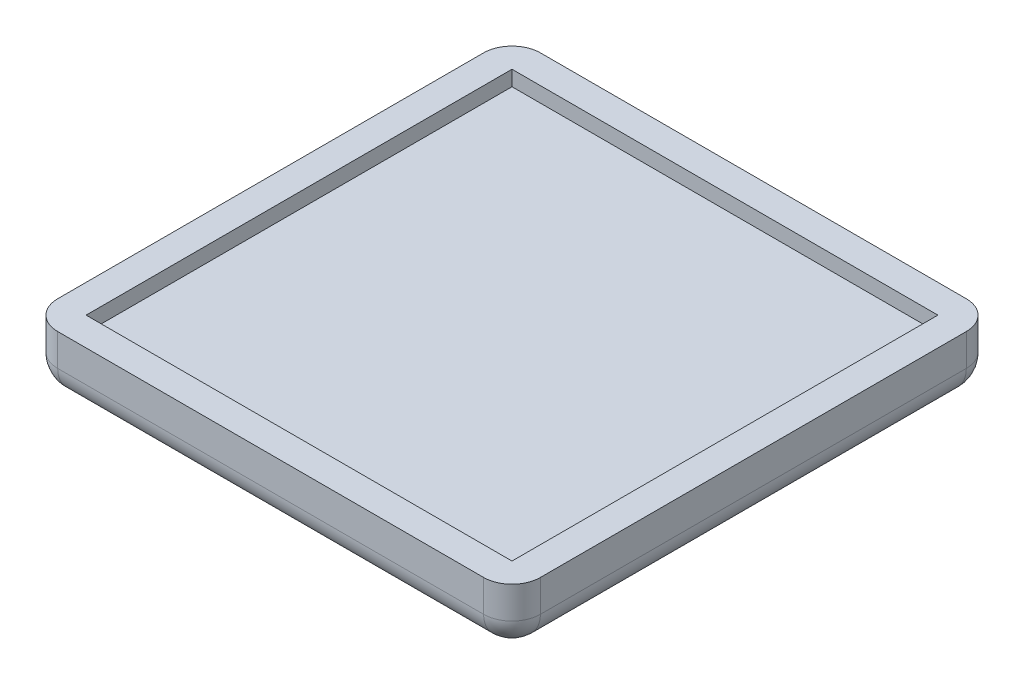
ISO-10303-21;
HEADER;
FILE_DESCRIPTION(('STEP AP214'),'2;1');
FILE_NAME('part.step','',(''),(''),'','','');
FILE_SCHEMA(('AUTOMOTIVE_DESIGN { 1 0 10303 214 1 1 1 1 }'));
ENDSEC;
DATA;
#1=APPLICATION_CONTEXT('core data for automotive mechanical design processes');
#2=APPLICATION_PROTOCOL_DEFINITION('international standard','automotive_design',2000,#1);
#3=PRODUCT_CONTEXT('',#1,'mechanical');
#4=PRODUCT('Part','Part','',(#3));
#5=PRODUCT_RELATED_PRODUCT_CATEGORY('part','',(#4));
#6=PRODUCT_DEFINITION_FORMATION('','',#4);
#7=PRODUCT_DEFINITION_CONTEXT('part definition',#1,'design');
#8=PRODUCT_DEFINITION('design','',#6,#7);
#9=PRODUCT_DEFINITION_SHAPE('','',#8);
#10=(LENGTH_UNIT() NAMED_UNIT(*) SI_UNIT(.MILLI.,.METRE.));
#11=(NAMED_UNIT(*) PLANE_ANGLE_UNIT() SI_UNIT($,.RADIAN.));
#12=(NAMED_UNIT(*) SI_UNIT($,.STERADIAN.) SOLID_ANGLE_UNIT());
#13=UNCERTAINTY_MEASURE_WITH_UNIT(LENGTH_MEASURE(1.E-05),#10,'distance_accuracy_value','');
#14=(GEOMETRIC_REPRESENTATION_CONTEXT(3) GLOBAL_UNCERTAINTY_ASSIGNED_CONTEXT((#13)) GLOBAL_UNIT_ASSIGNED_CONTEXT((#10,
#11,#12)) REPRESENTATION_CONTEXT('',''));
#15=CARTESIAN_POINT('',(0.,0.,0.));
#16=DIRECTION('',(0.,0.,1.));
#17=DIRECTION('',(1.,0.,0.));
#18=AXIS2_PLACEMENT_3D('',#15,#16,#17);
#19=CARTESIAN_POINT('',(0.,-5.715,0.));
#20=DIRECTION('',(0.,0.,1.));
#21=DIRECTION('',(1.,0.,0.));
#22=AXIS2_PLACEMENT_3D('',#19,#20,#21);
#23=PLANE('',#22);
#24=DIRECTION('',(1.,0.,0.));
#25=VECTOR('',#24,1.);
#26=CARTESIAN_POINT('',(76.2,-2.715,0.));
#27=LINE('',#26,#25);
#28=CARTESIAN_POINT('',(0.,-2.715,0.));
#29=VERTEX_POINT('',#28);
#30=CARTESIAN_POINT('',(76.2,-2.715,0.));
#31=VERTEX_POINT('',#30);
#32=EDGE_CURVE('E140',#29,#31,#27,.T.);
#33=ORIENTED_EDGE('',*,*,#32,.F.);
#34=DIRECTION('',(0.,1.,0.));
#35=VECTOR('',#34,1.);
#36=CARTESIAN_POINT('',(0.,-5.715,0.));
#37=LINE('',#36,#35);
#38=CARTESIAN_POINT('',(0.,0.,0.));
#39=VERTEX_POINT('',#38);
#40=EDGE_CURVE('E162',#29,#39,#37,.T.);
#41=ORIENTED_EDGE('',*,*,#40,.T.);
#42=DIRECTION('',(1.,0.,0.));
#43=VECTOR('',#42,1.);
#44=CARTESIAN_POINT('',(0.,0.,0.));
#45=LINE('',#44,#43);
#46=CARTESIAN_POINT('',(76.2,0.,0.));
#47=VERTEX_POINT('',#46);
#48=EDGE_CURVE('E256',#39,#47,#45,.T.);
#49=ORIENTED_EDGE('',*,*,#48,.T.);
#50=DIRECTION('',(0.,1.,0.));
#51=VECTOR('',#50,1.);
#52=CARTESIAN_POINT('',(76.2,-5.715,0.));
#53=LINE('',#52,#51);
#54=EDGE_CURVE('E158',#31,#47,#53,.T.);
#55=ORIENTED_EDGE('',*,*,#54,.F.);
#56=EDGE_LOOP('',(#33,#41,#49,#55));
#57=FACE_BOUND('',#56,.T.);
#58=ADVANCED_FACE('F37',(#57),#23,.F.);
#59=CARTESIAN_POINT('',(76.2,-5.715,0.));
#60=DIRECTION('',(1.,0.,0.));
#61=DIRECTION('',(0.,0.,-1.));
#62=AXIS2_PLACEMENT_3D('',#59,#60,#61);
#63=PLANE('',#62);
#64=DIRECTION('',(0.,0.,-1.));
#65=VECTOR('',#64,1.);
#66=CARTESIAN_POINT('',(76.2,-2.715,-76.2));
#67=LINE('',#66,#65);
#68=CARTESIAN_POINT('',(76.2,-2.715,-76.2));
#69=VERTEX_POINT('',#68);
#70=EDGE_CURVE('E137',#31,#69,#67,.T.);
#71=ORIENTED_EDGE('',*,*,#70,.F.);
#72=ORIENTED_EDGE('',*,*,#54,.T.);
#73=DIRECTION('',(0.,0.,-1.));
#74=VECTOR('',#73,1.);
#75=CARTESIAN_POINT('',(76.2,0.,0.));
#76=LINE('',#75,#74);
#77=CARTESIAN_POINT('',(76.2,0.,-76.2));
#78=VERTEX_POINT('',#77);
#79=EDGE_CURVE('E156',#47,#78,#76,.T.);
#80=ORIENTED_EDGE('',*,*,#79,.T.);
#81=DIRECTION('',(0.,1.,0.));
#82=VECTOR('',#81,1.);
#83=CARTESIAN_POINT('',(76.2,-5.715,-76.2));
#84=LINE('',#83,#82);
#85=EDGE_CURVE('E149',#69,#78,#84,.T.);
#86=ORIENTED_EDGE('',*,*,#85,.F.);
#87=EDGE_LOOP('',(#71,#72,#80,#86));
#88=FACE_BOUND('',#87,.T.);
#89=ADVANCED_FACE('F154',(#88),#63,.F.);
#90=CARTESIAN_POINT('',(0.,-5.715,-76.2));
#91=DIRECTION('',(0.,0.,1.));
#92=DIRECTION('',(1.,0.,0.));
#93=AXIS2_PLACEMENT_3D('',#90,#91,#92);
#94=PLANE('',#93);
#95=DIRECTION('',(0.,1.,0.));
#96=VECTOR('',#95,1.);
#97=CARTESIAN_POINT('',(0.,-5.715,-76.2));
#98=LINE('',#97,#96);
#99=CARTESIAN_POINT('',(0.,-2.715,-76.2));
#100=VERTEX_POINT('',#99);
#101=CARTESIAN_POINT('',(0.,0.,-76.2));
#102=VERTEX_POINT('',#101);
#103=EDGE_CURVE('E151',#100,#102,#98,.T.);
#104=ORIENTED_EDGE('',*,*,#103,.F.);
#105=DIRECTION('',(-1.,0.,0.));
#106=VECTOR('',#105,1.);
#107=CARTESIAN_POINT('',(76.2,-2.715,-76.2));
#108=LINE('',#107,#106);
#109=EDGE_CURVE('E54',#69,#100,#108,.T.);
#110=ORIENTED_EDGE('',*,*,#109,.F.);
#111=ORIENTED_EDGE('',*,*,#85,.T.);
#112=DIRECTION('',(1.,0.,0.));
#113=VECTOR('',#112,1.);
#114=CARTESIAN_POINT('',(0.,0.,-76.2));
#115=LINE('',#114,#113);
#116=EDGE_CURVE('E262',#102,#78,#115,.T.);
#117=ORIENTED_EDGE('',*,*,#116,.F.);
#118=EDGE_LOOP('',(#104,#110,#111,#117));
#119=FACE_BOUND('',#118,.T.);
#120=ADVANCED_FACE('F147',(#119),#94,.T.);
#121=CARTESIAN_POINT('',(0.,-5.715,0.));
#122=DIRECTION('',(1.,0.,0.));
#123=DIRECTION('',(0.,0.,-1.));
#124=AXIS2_PLACEMENT_3D('',#121,#122,#123);
#125=PLANE('',#124);
#126=ORIENTED_EDGE('',*,*,#40,.F.);
#127=DIRECTION('',(0.,0.,1.));
#128=VECTOR('',#127,1.);
#129=CARTESIAN_POINT('',(0.,-2.715,-76.2));
#130=LINE('',#129,#128);
#131=EDGE_CURVE('E152',#100,#29,#130,.T.);
#132=ORIENTED_EDGE('',*,*,#131,.F.);
#133=ORIENTED_EDGE('',*,*,#103,.T.);
#134=DIRECTION('',(0.,0.,-1.));
#135=VECTOR('',#134,1.);
#136=CARTESIAN_POINT('',(0.,0.,0.));
#137=LINE('',#136,#135);
#138=EDGE_CURVE('E259',#39,#102,#137,.T.);
#139=ORIENTED_EDGE('',*,*,#138,.F.);
#140=EDGE_LOOP('',(#126,#132,#133,#139));
#141=FACE_BOUND('',#140,.T.);
#142=ADVANCED_FACE('F269',(#141),#125,.T.);
#143=CARTESIAN_POINT('',(0.,-5.715,5.08));
#144=DIRECTION('',(0.,0.,-1.));
#145=DIRECTION('',(-1.,0.,0.));
#146=AXIS2_PLACEMENT_3D('',#143,#144,#145);
#147=PLANE('',#146);
#148=DIRECTION('',(-1.,0.,0.));
#149=VECTOR('',#148,1.);
#150=CARTESIAN_POINT('',(0.,0.,5.08));
#151=LINE('',#150,#149);
#152=CARTESIAN_POINT('',(76.2,0.,5.07999999999997));
#153=VERTEX_POINT('',#152);
#154=CARTESIAN_POINT('',(0.,0.,5.08));
#155=VERTEX_POINT('',#154);
#156=EDGE_CURVE('E238',#153,#155,#151,.T.);
#157=ORIENTED_EDGE('',*,*,#156,.T.);
#158=DIRECTION('',(0.,1.,0.));
#159=VECTOR('',#158,1.);
#160=CARTESIAN_POINT('',(0.,-5.715,5.08));
#161=LINE('',#160,#159);
#162=CARTESIAN_POINT('',(0.,-5.715,5.08));
#163=VERTEX_POINT('',#162);
#164=EDGE_CURVE('E194',#155,#163,#161,.F.);
#165=ORIENTED_EDGE('',*,*,#164,.T.);
#166=DIRECTION('',(-1.,0.,0.));
#167=VECTOR('',#166,1.);
#168=CARTESIAN_POINT('',(0.,-5.715,5.08));
#169=LINE('',#168,#167);
#170=CARTESIAN_POINT('',(76.2,-5.715,5.07999999999997));
#171=VERTEX_POINT('',#170);
#172=EDGE_CURVE('E192',#163,#171,#169,.F.);
#173=ORIENTED_EDGE('',*,*,#172,.T.);
#174=DIRECTION('',(0.,1.,0.));
#175=VECTOR('',#174,1.);
#176=CARTESIAN_POINT('',(76.2,0.,5.07999999999997));
#177=LINE('',#176,#175);
#178=EDGE_CURVE('E190',#171,#153,#177,.T.);
#179=ORIENTED_EDGE('',*,*,#178,.T.);
#180=EDGE_LOOP('',(#157,#165,#173,#179));
#181=FACE_BOUND('',#180,.T.);
#182=ADVANCED_FACE('F284',(#181),#147,.F.);
#183=CARTESIAN_POINT('',(-5.08,-5.715,0.));
#184=DIRECTION('',(1.,0.,0.));
#185=DIRECTION('',(0.,0.,-1.));
#186=AXIS2_PLACEMENT_3D('',#183,#184,#185);
#187=PLANE('',#186);
#188=DIRECTION('',(0.,0.,-1.));
#189=VECTOR('',#188,1.);
#190=CARTESIAN_POINT('',(-5.08,-5.715,0.));
#191=LINE('',#190,#189);
#192=CARTESIAN_POINT('',(-5.08,-5.715,-76.2));
#193=VERTEX_POINT('',#192);
#194=CARTESIAN_POINT('',(-5.08,-5.715,0.));
#195=VERTEX_POINT('',#194);
#196=EDGE_CURVE('E177',#193,#195,#191,.F.);
#197=ORIENTED_EDGE('',*,*,#196,.T.);
#198=DIRECTION('',(0.,1.,0.));
#199=VECTOR('',#198,1.);
#200=CARTESIAN_POINT('',(-5.08,-5.715,0.));
#201=LINE('',#200,#199);
#202=CARTESIAN_POINT('',(-5.08,0.,0.));
#203=VERTEX_POINT('',#202);
#204=EDGE_CURVE('E180',#195,#203,#201,.T.);
#205=ORIENTED_EDGE('',*,*,#204,.T.);
#206=DIRECTION('',(0.,0.,-1.));
#207=VECTOR('',#206,1.);
#208=CARTESIAN_POINT('',(-5.08,0.,0.));
#209=LINE('',#208,#207);
#210=CARTESIAN_POINT('',(-5.08,0.,-76.2));
#211=VERTEX_POINT('',#210);
#212=EDGE_CURVE('E253',#203,#211,#209,.T.);
#213=ORIENTED_EDGE('',*,*,#212,.T.);
#214=DIRECTION('',(0.,1.,0.));
#215=VECTOR('',#214,1.);
#216=CARTESIAN_POINT('',(-5.08,-5.715,-76.2));
#217=LINE('',#216,#215);
#218=EDGE_CURVE('E175',#211,#193,#217,.F.);
#219=ORIENTED_EDGE('',*,*,#218,.T.);
#220=EDGE_LOOP('',(#197,#205,#213,#219));
#221=FACE_BOUND('',#220,.T.);
#222=ADVANCED_FACE('F280',(#221),#187,.F.);
#223=CARTESIAN_POINT('',(0.,-5.715,-81.28));
#224=DIRECTION('',(0.,0.,1.));
#225=DIRECTION('',(1.,0.,0.));
#226=AXIS2_PLACEMENT_3D('',#223,#224,#225);
#227=PLANE('',#226);
#228=DIRECTION('',(1.,0.,0.));
#229=VECTOR('',#228,1.);
#230=CARTESIAN_POINT('',(0.,0.,-81.28));
#231=LINE('',#230,#229);
#232=CARTESIAN_POINT('',(0.,0.,-81.28));
#233=VERTEX_POINT('',#232);
#234=CARTESIAN_POINT('',(76.2,0.,-81.28));
#235=VERTEX_POINT('',#234);
#236=EDGE_CURVE('E247',#233,#235,#231,.T.);
#237=ORIENTED_EDGE('',*,*,#236,.T.);
#238=DIRECTION('',(0.,1.,0.));
#239=VECTOR('',#238,1.);
#240=CARTESIAN_POINT('',(76.2,-10.795,-81.28));
#241=LINE('',#240,#239);
#242=CARTESIAN_POINT('',(76.2,-5.715,-81.28));
#243=VERTEX_POINT('',#242);
#244=EDGE_CURVE('E11',#235,#243,#241,.F.);
#245=ORIENTED_EDGE('',*,*,#244,.T.);
#246=DIRECTION('',(1.,0.,0.));
#247=VECTOR('',#246,1.);
#248=CARTESIAN_POINT('',(0.,-5.715,-81.28));
#249=LINE('',#248,#247);
#250=CARTESIAN_POINT('',(0.,-5.715,-81.28));
#251=VERTEX_POINT('',#250);
#252=EDGE_CURVE('E46',#243,#251,#249,.F.);
#253=ORIENTED_EDGE('',*,*,#252,.T.);
#254=DIRECTION('',(0.,1.,0.));
#255=VECTOR('',#254,1.);
#256=CARTESIAN_POINT('',(0.,-5.715,-81.28));
#257=LINE('',#256,#255);
#258=EDGE_CURVE('E202',#251,#233,#257,.T.);
#259=ORIENTED_EDGE('',*,*,#258,.T.);
#260=EDGE_LOOP('',(#237,#245,#253,#259));
#261=FACE_BOUND('',#260,.T.);
#262=ADVANCED_FACE('F283',(#261),#227,.F.);
#263=CARTESIAN_POINT('',(81.28,-5.715,0.));
#264=DIRECTION('',(1.,0.,0.));
#265=DIRECTION('',(0.,0.,-1.));
#266=AXIS2_PLACEMENT_3D('',#263,#264,#265);
#267=PLANE('',#266);
#268=DIRECTION('',(0.,0.,-1.));
#269=VECTOR('',#268,1.);
#270=CARTESIAN_POINT('',(81.28,0.,0.));
#271=LINE('',#270,#269);
#272=CARTESIAN_POINT('',(81.28,0.,0.));
#273=VERTEX_POINT('',#272);
#274=CARTESIAN_POINT('',(81.28,0.,-76.2));
#275=VERTEX_POINT('',#274);
#276=EDGE_CURVE('E241',#273,#275,#271,.T.);
#277=ORIENTED_EDGE('',*,*,#276,.F.);
#278=DIRECTION('',(0.,1.,0.));
#279=VECTOR('',#278,1.);
#280=CARTESIAN_POINT('',(81.28,-10.795,0.));
#281=LINE('',#280,#279);
#282=CARTESIAN_POINT('',(81.28,-5.715,0.));
#283=VERTEX_POINT('',#282);
#284=EDGE_CURVE('E200',#273,#283,#281,.F.);
#285=ORIENTED_EDGE('',*,*,#284,.T.);
#286=DIRECTION('',(0.,0.,1.));
#287=VECTOR('',#286,1.);
#288=CARTESIAN_POINT('',(81.28,-5.715,-81.28));
#289=LINE('',#288,#287);
#290=CARTESIAN_POINT('',(81.28,-5.715,-76.2));
#291=VERTEX_POINT('',#290);
#292=EDGE_CURVE('E198',#283,#291,#289,.F.);
#293=ORIENTED_EDGE('',*,*,#292,.T.);
#294=DIRECTION('',(0.,1.,0.));
#295=VECTOR('',#294,1.);
#296=CARTESIAN_POINT('',(81.28,0.,-76.2));
#297=LINE('',#296,#295);
#298=EDGE_CURVE('E196',#291,#275,#297,.T.);
#299=ORIENTED_EDGE('',*,*,#298,.T.);
#300=EDGE_LOOP('',(#277,#285,#293,#299));
#301=FACE_BOUND('',#300,.T.);
#302=ADVANCED_FACE('F288',(#301),#267,.T.);
#303=CARTESIAN_POINT('',(0.,0.,0.));
#304=DIRECTION('',(0.,1.,0.));
#305=DIRECTION('',(0.,0.,1.));
#306=AXIS2_PLACEMENT_3D('',#303,#304,#305);
#307=PLANE('',#306);
#308=ORIENTED_EDGE('',*,*,#212,.F.);
#309=CARTESIAN_POINT('',(0.,0.,0.));
#310=DIRECTION('',(0.,1.,0.));
#311=DIRECTION('',(0.,0.,1.));
#312=AXIS2_PLACEMENT_3D('',#309,#310,#311);
#313=CIRCLE('',#312,5.08);
#314=EDGE_CURVE('E188',#203,#155,#313,.T.);
#315=ORIENTED_EDGE('',*,*,#314,.T.);
#316=ORIENTED_EDGE('',*,*,#156,.F.);
#317=CARTESIAN_POINT('',(76.2,0.,0.));
#318=DIRECTION('',(0.,1.,0.));
#319=DIRECTION('',(0.,0.,1.));
#320=AXIS2_PLACEMENT_3D('',#317,#318,#319);
#321=CIRCLE('',#320,5.08);
#322=EDGE_CURVE('E186',#153,#273,#321,.T.);
#323=ORIENTED_EDGE('',*,*,#322,.T.);
#324=ORIENTED_EDGE('',*,*,#276,.T.);
#325=CARTESIAN_POINT('',(76.2,0.,-76.2));
#326=DIRECTION('',(0.,1.,0.));
#327=DIRECTION('',(0.,0.,1.));
#328=AXIS2_PLACEMENT_3D('',#325,#326,#327);
#329=CIRCLE('',#328,5.08);
#330=EDGE_CURVE('E184',#275,#235,#329,.T.);
#331=ORIENTED_EDGE('',*,*,#330,.T.);
#332=ORIENTED_EDGE('',*,*,#236,.F.);
#333=CARTESIAN_POINT('',(0.,0.,-76.2));
#334=DIRECTION('',(0.,1.,0.));
#335=DIRECTION('',(0.,0.,1.));
#336=AXIS2_PLACEMENT_3D('',#333,#334,#335);
#337=CIRCLE('',#336,5.08);
#338=EDGE_CURVE('E182',#233,#211,#337,.T.);
#339=ORIENTED_EDGE('',*,*,#338,.T.);
#340=EDGE_LOOP('',(#308,#315,#316,#323,#324,#331,#332,#339));
#341=FACE_BOUND('',#340,.T.);
#342=ORIENTED_EDGE('',*,*,#48,.F.);
#343=ORIENTED_EDGE('',*,*,#138,.T.);
#344=ORIENTED_EDGE('',*,*,#116,.T.);
#345=ORIENTED_EDGE('',*,*,#79,.F.);
#346=EDGE_LOOP('',(#342,#343,#344,#345));
#347=FACE_BOUND('',#346,.T.);
#348=ADVANCED_FACE('F265',(#341,#347),#307,.T.);
#349=CARTESIAN_POINT('',(0.,-10.795,0.));
#350=DIRECTION('',(0.,1.,0.));
#351=DIRECTION('',(0.,0.,1.));
#352=AXIS2_PLACEMENT_3D('',#349,#350,#351);
#353=PLANE('',#352);
#354=DIRECTION('',(-1.,0.,0.));
#355=VECTOR('',#354,1.);
#356=CARTESIAN_POINT('',(0.,-10.795,0.));
#357=LINE('',#356,#355);
#358=CARTESIAN_POINT('',(76.2,-10.795,0.));
#359=VERTEX_POINT('',#358);
#360=CARTESIAN_POINT('',(0.,-10.795,0.));
#361=VERTEX_POINT('',#360);
#362=EDGE_CURVE('E170',#359,#361,#357,.T.);
#363=ORIENTED_EDGE('',*,*,#362,.T.);
#364=DIRECTION('',(0.,0.,-1.));
#365=VECTOR('',#364,1.);
#366=CARTESIAN_POINT('',(0.,-10.795,0.));
#367=LINE('',#366,#365);
#368=CARTESIAN_POINT('',(0.,-10.795,-76.2));
#369=VERTEX_POINT('',#368);
#370=EDGE_CURVE('E172',#361,#369,#367,.T.);
#371=ORIENTED_EDGE('',*,*,#370,.T.);
#372=DIRECTION('',(1.,0.,0.));
#373=VECTOR('',#372,1.);
#374=CARTESIAN_POINT('',(0.,-10.795,-76.2));
#375=LINE('',#374,#373);
#376=CARTESIAN_POINT('',(76.2,-10.795,-76.2));
#377=VERTEX_POINT('',#376);
#378=EDGE_CURVE('E160',#369,#377,#375,.T.);
#379=ORIENTED_EDGE('',*,*,#378,.T.);
#380=DIRECTION('',(0.,0.,1.));
#381=VECTOR('',#380,1.);
#382=CARTESIAN_POINT('',(76.2,-10.795,5.08));
#383=LINE('',#382,#381);
#384=EDGE_CURVE('E168',#377,#359,#383,.T.);
#385=ORIENTED_EDGE('',*,*,#384,.T.);
#386=EDGE_LOOP('',(#363,#371,#379,#385));
#387=FACE_BOUND('',#386,.T.);
#388=ADVANCED_FACE('F338',(#387),#353,.F.);
#389=CARTESIAN_POINT('',(76.2,-5.715,0.));
#390=DIRECTION('',(0.,-1.,0.));
#391=DIRECTION('',(0.,0.,-1.));
#392=AXIS2_PLACEMENT_3D('',#389,#390,#391);
#393=CYLINDRICAL_SURFACE('',#392,5.08);
#394=ORIENTED_EDGE('',*,*,#322,.F.);
#395=ORIENTED_EDGE('',*,*,#178,.F.);
#396=CARTESIAN_POINT('',(76.2,-5.715,0.));
#397=DIRECTION('',(0.,-1.,0.));
#398=DIRECTION('',(0.,0.,-1.));
#399=AXIS2_PLACEMENT_3D('',#396,#397,#398);
#400=CIRCLE('',#399,5.08);
#401=EDGE_CURVE('E41',#283,#171,#400,.T.);
#402=ORIENTED_EDGE('',*,*,#401,.F.);
#403=ORIENTED_EDGE('',*,*,#284,.F.);
#404=EDGE_LOOP('',(#394,#395,#402,#403));
#405=FACE_BOUND('',#404,.T.);
#406=ADVANCED_FACE('F39',(#405),#393,.T.);
#407=CARTESIAN_POINT('',(76.2,-5.715,0.));
#408=DIRECTION('',(0.,0.,-1.));
#409=DIRECTION('',(-1.,0.,0.));
#410=AXIS2_PLACEMENT_3D('',#407,#408,#409);
#411=CYLINDRICAL_SURFACE('',#410,5.08);
#412=CARTESIAN_POINT('',(76.2,-5.715,-76.2));
#413=DIRECTION('',(0.,0.,-1.));
#414=DIRECTION('',(-1.,0.,0.));
#415=AXIS2_PLACEMENT_3D('',#412,#413,#414);
#416=CIRCLE('',#415,5.08);
#417=EDGE_CURVE('E230',#291,#377,#416,.T.);
#418=ORIENTED_EDGE('',*,*,#417,.F.);
#419=ORIENTED_EDGE('',*,*,#292,.F.);
#420=CARTESIAN_POINT('',(76.2,-5.715,0.));
#421=DIRECTION('',(0.,0.,1.));
#422=DIRECTION('',(1.,0.,0.));
#423=AXIS2_PLACEMENT_3D('',#420,#421,#422);
#424=CIRCLE('',#423,5.08);
#425=EDGE_CURVE('E232',#359,#283,#424,.T.);
#426=ORIENTED_EDGE('',*,*,#425,.F.);
#427=ORIENTED_EDGE('',*,*,#384,.F.);
#428=EDGE_LOOP('',(#418,#419,#426,#427));
#429=FACE_BOUND('',#428,.T.);
#430=ADVANCED_FACE('F331',(#429),#411,.T.);
#431=CARTESIAN_POINT('',(76.2,-5.715,-76.2));
#432=DIRECTION('',(0.,-1.,0.));
#433=DIRECTION('',(0.,0.,-1.));
#434=AXIS2_PLACEMENT_3D('',#431,#432,#433);
#435=CYLINDRICAL_SURFACE('',#434,5.08);
#436=ORIENTED_EDGE('',*,*,#330,.F.);
#437=ORIENTED_EDGE('',*,*,#298,.F.);
#438=CARTESIAN_POINT('',(76.2,-5.715,-76.2));
#439=DIRECTION('',(0.,-1.,0.));
#440=DIRECTION('',(0.,0.,-1.));
#441=AXIS2_PLACEMENT_3D('',#438,#439,#440);
#442=CIRCLE('',#441,5.08);
#443=EDGE_CURVE('E227',#243,#291,#442,.T.);
#444=ORIENTED_EDGE('',*,*,#443,.F.);
#445=ORIENTED_EDGE('',*,*,#244,.F.);
#446=EDGE_LOOP('',(#436,#437,#444,#445));
#447=FACE_BOUND('',#446,.T.);
#448=ADVANCED_FACE('F329',(#447),#435,.T.);
#449=CARTESIAN_POINT('',(76.2,-5.715,0.));
#450=DIRECTION('',(0.,0.,1.));
#451=DIRECTION('',(1.,0.,0.));
#452=AXIS2_PLACEMENT_3D('',#449,#450,#451);
#453=SPHERICAL_SURFACE('',#452,5.08);
#454=ORIENTED_EDGE('',*,*,#425,.T.);
#455=ORIENTED_EDGE('',*,*,#401,.T.);
#456=CARTESIAN_POINT('',(76.2,-5.715,0.));
#457=DIRECTION('',(1.,0.,0.));
#458=DIRECTION('',(0.,0.,-1.));
#459=AXIS2_PLACEMENT_3D('',#456,#457,#458);
#460=CIRCLE('',#459,5.08);
#461=EDGE_CURVE('E224',#359,#171,#460,.F.);
#462=ORIENTED_EDGE('',*,*,#461,.F.);
#463=EDGE_LOOP('',(#454,#455,#462));
#464=FACE_BOUND('',#463,.T.);
#465=ADVANCED_FACE('F325',(#464),#453,.T.);
#466=CARTESIAN_POINT('',(76.2,-5.715,-76.2));
#467=DIRECTION('',(0.,0.,1.));
#468=DIRECTION('',(1.,0.,0.));
#469=AXIS2_PLACEMENT_3D('',#466,#467,#468);
#470=SPHERICAL_SURFACE('',#469,5.08);
#471=ORIENTED_EDGE('',*,*,#443,.T.);
#472=ORIENTED_EDGE('',*,*,#417,.T.);
#473=CARTESIAN_POINT('',(76.2,-5.715,-76.2));
#474=DIRECTION('',(1.,0.,0.));
#475=DIRECTION('',(0.,0.,-1.));
#476=AXIS2_PLACEMENT_3D('',#473,#474,#475);
#477=CIRCLE('',#476,5.08);
#478=EDGE_CURVE('E221',#243,#377,#477,.F.);
#479=ORIENTED_EDGE('',*,*,#478,.F.);
#480=EDGE_LOOP('',(#471,#472,#479));
#481=FACE_BOUND('',#480,.T.);
#482=ADVANCED_FACE('F321',(#481),#470,.T.);
#483=CARTESIAN_POINT('',(0.,-5.715,0.));
#484=DIRECTION('',(0.,1.,0.));
#485=DIRECTION('',(0.,0.,1.));
#486=AXIS2_PLACEMENT_3D('',#483,#484,#485);
#487=CYLINDRICAL_SURFACE('',#486,5.08);
#488=ORIENTED_EDGE('',*,*,#314,.F.);
#489=ORIENTED_EDGE('',*,*,#204,.F.);
#490=CARTESIAN_POINT('',(0.,-5.715,0.));
#491=DIRECTION('',(0.,-1.,0.));
#492=DIRECTION('',(0.,0.,-1.));
#493=AXIS2_PLACEMENT_3D('',#490,#491,#492);
#494=CIRCLE('',#493,5.08);
#495=EDGE_CURVE('E218',#163,#195,#494,.T.);
#496=ORIENTED_EDGE('',*,*,#495,.F.);
#497=ORIENTED_EDGE('',*,*,#164,.F.);
#498=EDGE_LOOP('',(#488,#489,#496,#497));
#499=FACE_BOUND('',#498,.T.);
#500=ADVANCED_FACE('F317',(#499),#487,.T.);
#501=CARTESIAN_POINT('',(0.,-5.715,0.));
#502=DIRECTION('',(-1.,0.,0.));
#503=DIRECTION('',(0.,0.,1.));
#504=AXIS2_PLACEMENT_3D('',#501,#502,#503);
#505=CYLINDRICAL_SURFACE('',#504,5.08);
#506=ORIENTED_EDGE('',*,*,#461,.T.);
#507=ORIENTED_EDGE('',*,*,#172,.F.);
#508=CARTESIAN_POINT('',(0.,-5.715,0.));
#509=DIRECTION('',(-1.,0.,0.));
#510=DIRECTION('',(0.,0.,1.));
#511=AXIS2_PLACEMENT_3D('',#508,#509,#510);
#512=CIRCLE('',#511,5.08);
#513=EDGE_CURVE('E215',#361,#163,#512,.T.);
#514=ORIENTED_EDGE('',*,*,#513,.F.);
#515=ORIENTED_EDGE('',*,*,#362,.F.);
#516=EDGE_LOOP('',(#506,#507,#514,#515));
#517=FACE_BOUND('',#516,.T.);
#518=ADVANCED_FACE('F313',(#517),#505,.T.);
#519=CARTESIAN_POINT('',(0.,-5.715,-76.2));
#520=DIRECTION('',(1.,0.,0.));
#521=DIRECTION('',(0.,0.,-1.));
#522=AXIS2_PLACEMENT_3D('',#519,#520,#521);
#523=CYLINDRICAL_SURFACE('',#522,5.08);
#524=ORIENTED_EDGE('',*,*,#478,.T.);
#525=ORIENTED_EDGE('',*,*,#378,.F.);
#526=CARTESIAN_POINT('',(0.,-5.715,-76.2));
#527=DIRECTION('',(-1.,0.,0.));
#528=DIRECTION('',(0.,0.,1.));
#529=AXIS2_PLACEMENT_3D('',#526,#527,#528);
#530=CIRCLE('',#529,5.08);
#531=EDGE_CURVE('E212',#251,#369,#530,.T.);
#532=ORIENTED_EDGE('',*,*,#531,.F.);
#533=ORIENTED_EDGE('',*,*,#252,.F.);
#534=EDGE_LOOP('',(#524,#525,#532,#533));
#535=FACE_BOUND('',#534,.T.);
#536=ADVANCED_FACE('F309',(#535),#523,.T.);
#537=CARTESIAN_POINT('',(0.,-5.715,-76.2));
#538=DIRECTION('',(0.,1.,0.));
#539=DIRECTION('',(0.,0.,1.));
#540=AXIS2_PLACEMENT_3D('',#537,#538,#539);
#541=CYLINDRICAL_SURFACE('',#540,5.08);
#542=ORIENTED_EDGE('',*,*,#338,.F.);
#543=ORIENTED_EDGE('',*,*,#258,.F.);
#544=CARTESIAN_POINT('',(0.,-5.715,-76.2));
#545=DIRECTION('',(0.,-1.,0.));
#546=DIRECTION('',(0.,0.,-1.));
#547=AXIS2_PLACEMENT_3D('',#544,#545,#546);
#548=CIRCLE('',#547,5.08);
#549=EDGE_CURVE('E209',#193,#251,#548,.T.);
#550=ORIENTED_EDGE('',*,*,#549,.F.);
#551=ORIENTED_EDGE('',*,*,#218,.F.);
#552=EDGE_LOOP('',(#542,#543,#550,#551));
#553=FACE_BOUND('',#552,.T.);
#554=ADVANCED_FACE('F305',(#553),#541,.T.);
#555=CARTESIAN_POINT('',(0.,-5.715,0.));
#556=DIRECTION('',(0.,0.,1.));
#557=DIRECTION('',(1.,0.,0.));
#558=AXIS2_PLACEMENT_3D('',#555,#556,#557);
#559=SPHERICAL_SURFACE('',#558,5.08);
#560=ORIENTED_EDGE('',*,*,#513,.T.);
#561=ORIENTED_EDGE('',*,*,#495,.T.);
#562=CARTESIAN_POINT('',(0.,-5.715,0.));
#563=DIRECTION('',(0.,0.,1.));
#564=DIRECTION('',(1.,0.,0.));
#565=AXIS2_PLACEMENT_3D('',#562,#563,#564);
#566=CIRCLE('',#565,5.08);
#567=EDGE_CURVE('E207',#361,#195,#566,.F.);
#568=ORIENTED_EDGE('',*,*,#567,.F.);
#569=EDGE_LOOP('',(#560,#561,#568));
#570=FACE_BOUND('',#569,.T.);
#571=ADVANCED_FACE('F301',(#570),#559,.T.);
#572=CARTESIAN_POINT('',(0.,-5.715,-76.2));
#573=DIRECTION('',(0.,0.,1.));
#574=DIRECTION('',(1.,0.,0.));
#575=AXIS2_PLACEMENT_3D('',#572,#573,#574);
#576=SPHERICAL_SURFACE('',#575,5.08);
#577=ORIENTED_EDGE('',*,*,#549,.T.);
#578=ORIENTED_EDGE('',*,*,#531,.T.);
#579=CARTESIAN_POINT('',(0.,-5.715,-76.2));
#580=DIRECTION('',(0.,0.,-1.));
#581=DIRECTION('',(-1.,0.,0.));
#582=AXIS2_PLACEMENT_3D('',#579,#580,#581);
#583=CIRCLE('',#582,5.08);
#584=EDGE_CURVE('E205',#193,#369,#583,.F.);
#585=ORIENTED_EDGE('',*,*,#584,.F.);
#586=EDGE_LOOP('',(#577,#578,#585));
#587=FACE_BOUND('',#586,.T.);
#588=ADVANCED_FACE('F297',(#587),#576,.T.);
#589=CARTESIAN_POINT('',(0.,-5.715,0.));
#590=DIRECTION('',(0.,0.,-1.));
#591=DIRECTION('',(-1.,0.,0.));
#592=AXIS2_PLACEMENT_3D('',#589,#590,#591);
#593=CYLINDRICAL_SURFACE('',#592,5.08);
#594=ORIENTED_EDGE('',*,*,#567,.T.);
#595=ORIENTED_EDGE('',*,*,#196,.F.);
#596=ORIENTED_EDGE('',*,*,#584,.T.);
#597=ORIENTED_EDGE('',*,*,#370,.F.);
#598=EDGE_LOOP('',(#594,#595,#596,#597));
#599=FACE_BOUND('',#598,.T.);
#600=ADVANCED_FACE('F294',(#599),#593,.T.);
#601=CARTESIAN_POINT('',(0.,-2.715,0.));
#602=DIRECTION('',(0.,-1.,0.));
#603=DIRECTION('',(0.,0.,-1.));
#604=AXIS2_PLACEMENT_3D('',#601,#602,#603);
#605=PLANE('',#604);
#606=ORIENTED_EDGE('',*,*,#70,.T.);
#607=ORIENTED_EDGE('',*,*,#109,.T.);
#608=ORIENTED_EDGE('',*,*,#131,.T.);
#609=ORIENTED_EDGE('',*,*,#32,.T.);
#610=EDGE_LOOP('',(#606,#607,#608,#609));
#611=FACE_BOUND('',#610,.T.);
#612=ADVANCED_FACE('F138',(#611),#605,.F.);
#613=CLOSED_SHELL('',(#58,#89,#120,#142,#182,#222,#262,#302,#348,#388,#406,#430,#448,#465,#482,
#500,#518,#536,#554,#571,#588,#600,#612));
#614=MANIFOLD_SOLID_BREP('B2',#613);
#615=ADVANCED_BREP_SHAPE_REPRESENTATION('',(#18,#614),#14);
#616=SHAPE_DEFINITION_REPRESENTATION(#9,#615);
ENDSEC;
END-ISO-10303-21;
